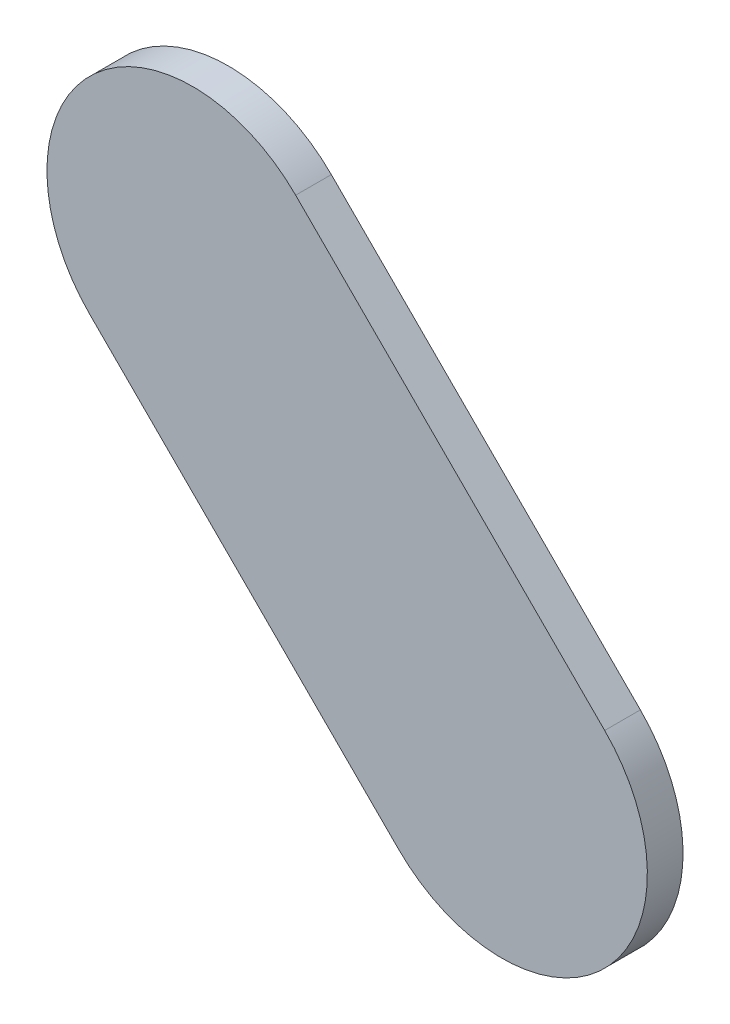
ISO-10303-21;
HEADER;
FILE_DESCRIPTION(('STEP AP214'),'2;1');
FILE_NAME('part.step','',(''),(''),'','','');
FILE_SCHEMA(('AUTOMOTIVE_DESIGN { 1 0 10303 214 1 1 1 1 }'));
ENDSEC;
DATA;
#1=APPLICATION_CONTEXT('core data for automotive mechanical design processes');
#2=APPLICATION_PROTOCOL_DEFINITION('international standard','automotive_design',2000,#1);
#3=PRODUCT_CONTEXT('',#1,'mechanical');
#4=PRODUCT('Part','Part','',(#3));
#5=PRODUCT_RELATED_PRODUCT_CATEGORY('part','',(#4));
#6=PRODUCT_DEFINITION_FORMATION('','',#4);
#7=PRODUCT_DEFINITION_CONTEXT('part definition',#1,'design');
#8=PRODUCT_DEFINITION('design','',#6,#7);
#9=PRODUCT_DEFINITION_SHAPE('','',#8);
#10=(LENGTH_UNIT() NAMED_UNIT(*) SI_UNIT(.MILLI.,.METRE.));
#11=(NAMED_UNIT(*) PLANE_ANGLE_UNIT() SI_UNIT($,.RADIAN.));
#12=(NAMED_UNIT(*) SI_UNIT($,.STERADIAN.) SOLID_ANGLE_UNIT());
#13=UNCERTAINTY_MEASURE_WITH_UNIT(LENGTH_MEASURE(1.E-05),#10,'distance_accuracy_value','');
#14=(GEOMETRIC_REPRESENTATION_CONTEXT(3) GLOBAL_UNCERTAINTY_ASSIGNED_CONTEXT((#13)) GLOBAL_UNIT_ASSIGNED_CONTEXT((#10,
#11,#12)) REPRESENTATION_CONTEXT('',''));
#15=CARTESIAN_POINT('',(0.,0.,0.));
#16=DIRECTION('',(0.,0.,1.));
#17=DIRECTION('',(1.,0.,0.));
#18=AXIS2_PLACEMENT_3D('',#15,#16,#17);
#19=CARTESIAN_POINT('',(4.433035666303,7.678591372288,0.76487));
#20=DIRECTION('',(0.,0.,-1.));
#21=DIRECTION('',(-1.,0.,0.));
#22=AXIS2_PLACEMENT_3D('',#19,#20,#21);
#23=PLANE('',#22);
#24=DIRECTION('',(0.707105987136602,-0.707107575235602,0.));
#25=VECTOR('',#24,1.);
#26=CARTESIAN_POINT('',(4.383645000001,7.925453,0.76487));
#27=LINE('',#26,#25);
#28=CARTESIAN_POINT('',(4.38364503026748,7.92545296973368,0.76487));
#29=VERTEX_POINT('',#28);
#30=CARTESIAN_POINT('',(4.68062955533316,7.62846777766617,0.76487));
#31=VERTEX_POINT('',#30);
#32=EDGE_CURVE('E54',#29,#31,#27,.T.);
#33=ORIENTED_EDGE('',*,*,#32,.T.);
#34=CARTESIAN_POINT('',(4.581634667,7.529472667,0.76487));
#35=DIRECTION('',(0.,0.,1.));
#36=DIRECTION('',(1.,0.,0.));
#37=AXIS2_PLACEMENT_3D('',#34,#35,#36);
#38=CIRCLE('',#37,0.140000070901);
#39=CARTESIAN_POINT('',(4.48263974790159,7.43047825310059,0.76487));
#40=VERTEX_POINT('',#39);
#41=EDGE_CURVE('E20',#40,#31,#38,.T.);
#42=ORIENTED_EDGE('',*,*,#41,.F.);
#43=DIRECTION('',(-0.707107575236102,0.707105987136102,0.));
#44=VECTOR('',#43,1.);
#45=CARTESIAN_POINT('',(4.482639667001,7.430478334001,0.76487));
#46=LINE('',#45,#44);
#47=CARTESIAN_POINT('',(4.18565455583361,7.72746277816655,0.76487));
#48=VERTEX_POINT('',#47);
#49=EDGE_CURVE('E78',#40,#48,#46,.T.);
#50=ORIENTED_EDGE('',*,*,#49,.T.);
#51=CARTESIAN_POINT('',(4.284649333,7.826458,0.76487));
#52=DIRECTION('',(0.,0.,1.));
#53=DIRECTION('',(1.,0.,0.));
#54=AXIS2_PLACEMENT_3D('',#51,#52,#53);
#55=CIRCLE('',#54,0.140000070901);
#56=EDGE_CURVE('E58',#29,#48,#55,.T.);
#57=ORIENTED_EDGE('',*,*,#56,.F.);
#58=EDGE_LOOP('',(#33,#42,#50,#57));
#59=FACE_BOUND('',#58,.T.);
#60=ADVANCED_FACE('F17',(#59),#23,.T.);
#61=CARTESIAN_POINT('',(4.581634667,7.529472667,0.76487));
#62=DIRECTION('',(0.,0.,1.));
#63=DIRECTION('',(1.,0.,0.));
#64=AXIS2_PLACEMENT_3D('',#61,#62,#63);
#65=CYLINDRICAL_SURFACE('',#64,0.140000070901);
#66=ORIENTED_EDGE('',*,*,#41,.T.);
#67=DIRECTION('',(0.,0.,1.));
#68=VECTOR('',#67,1.);
#69=CARTESIAN_POINT('',(4.68062933299991,7.62846799999991,0.76487));
#70=LINE('',#69,#68);
#71=CARTESIAN_POINT('',(4.68062955533321,7.62846777766625,0.79916));
#72=VERTEX_POINT('',#71);
#73=EDGE_CURVE('E62',#31,#72,#70,.T.);
#74=ORIENTED_EDGE('',*,*,#73,.T.);
#75=CARTESIAN_POINT('',(4.581634667001,7.529473232733,0.79916));
#76=DIRECTION('',(0.,0.,1.));
#77=DIRECTION('',(1.,0.,0.));
#78=AXIS2_PLACEMENT_3D('',#75,#76,#77);
#79=CIRCLE('',#78,0.14);
#80=CARTESIAN_POINT('',(4.48263974790162,7.43047825310056,0.79916));
#81=VERTEX_POINT('',#80);
#82=EDGE_CURVE('E82',#81,#72,#79,.T.);
#83=ORIENTED_EDGE('',*,*,#82,.F.);
#84=DIRECTION('',(0.,0.,1.));
#85=VECTOR('',#84,1.);
#86=CARTESIAN_POINT('',(4.482639667001,7.430478334001,0.76487));
#87=LINE('',#86,#85);
#88=EDGE_CURVE('E69',#81,#40,#87,.F.);
#89=ORIENTED_EDGE('',*,*,#88,.T.);
#90=EDGE_LOOP('',(#66,#74,#83,#89));
#91=FACE_BOUND('',#90,.T.);
#92=ADVANCED_FACE('F66',(#91),#65,.T.);
#93=CARTESIAN_POINT('',(4.383645000001,7.925453,0.76487));
#94=DIRECTION('',(-0.707107575235602,-0.707105987136602,0.));
#95=DIRECTION('',(0.707105987136602,-0.707107575235602,0.));
#96=AXIS2_PLACEMENT_3D('',#93,#94,#95);
#97=PLANE('',#96);
#98=ORIENTED_EDGE('',*,*,#73,.F.);
#99=ORIENTED_EDGE('',*,*,#32,.F.);
#100=DIRECTION('',(0.,0.,1.));
#101=VECTOR('',#100,1.);
#102=CARTESIAN_POINT('',(4.38364500000123,7.92545300000023,0.76487));
#103=LINE('',#102,#101);
#104=CARTESIAN_POINT('',(4.38364503026747,7.92545296973369,0.79916));
#105=VERTEX_POINT('',#104);
#106=EDGE_CURVE('E73',#105,#29,#103,.F.);
#107=ORIENTED_EDGE('',*,*,#106,.F.);
#108=DIRECTION('',(-0.707105987136806,0.707107575235397,0.));
#109=VECTOR('',#108,1.);
#110=CARTESIAN_POINT('',(4.680629333,7.628468,0.79916));
#111=LINE('',#110,#109);
#112=EDGE_CURVE('E72',#72,#105,#111,.T.);
#113=ORIENTED_EDGE('',*,*,#112,.F.);
#114=EDGE_LOOP('',(#98,#99,#107,#113));
#115=FACE_BOUND('',#114,.T.);
#116=ADVANCED_FACE('F71',(#115),#97,.F.);
#117=CARTESIAN_POINT('',(4.284649333,7.826458,0.76487));
#118=DIRECTION('',(0.,0.,1.));
#119=DIRECTION('',(1.,0.,0.));
#120=AXIS2_PLACEMENT_3D('',#117,#118,#119);
#121=CYLINDRICAL_SURFACE('',#120,0.140000070901);
#122=ORIENTED_EDGE('',*,*,#56,.T.);
#123=DIRECTION('',(0.,0.,1.));
#124=VECTOR('',#123,1.);
#125=CARTESIAN_POINT('',(4.1856546670002,7.7274626670002,0.76487));
#126=LINE('',#125,#124);
#127=CARTESIAN_POINT('',(4.18565455583354,7.72746277816641,0.79916));
#128=VERTEX_POINT('',#127);
#129=EDGE_CURVE('E79',#48,#128,#126,.T.);
#130=ORIENTED_EDGE('',*,*,#129,.T.);
#131=CARTESIAN_POINT('',(4.284649667,7.826457768268,0.79916));
#132=DIRECTION('',(0.,0.,1.));
#133=DIRECTION('',(1.,0.,0.));
#134=AXIS2_PLACEMENT_3D('',#131,#132,#133);
#135=CIRCLE('',#134,0.140000470934);
#136=EDGE_CURVE('E26',#105,#128,#135,.T.);
#137=ORIENTED_EDGE('',*,*,#136,.F.);
#138=ORIENTED_EDGE('',*,*,#106,.T.);
#139=EDGE_LOOP('',(#122,#130,#137,#138));
#140=FACE_BOUND('',#139,.T.);
#141=ADVANCED_FACE('F91',(#140),#121,.T.);
#142=CARTESIAN_POINT('',(4.482639667001,7.430478334001,0.76487));
#143=DIRECTION('',(0.707105987136102,0.707107575236102,0.));
#144=DIRECTION('',(-0.707107575236102,0.707105987136102,0.));
#145=AXIS2_PLACEMENT_3D('',#142,#143,#144);
#146=PLANE('',#145);
#147=ORIENTED_EDGE('',*,*,#129,.F.);
#148=ORIENTED_EDGE('',*,*,#49,.F.);
#149=ORIENTED_EDGE('',*,*,#88,.F.);
#150=DIRECTION('',(0.707107575236588,-0.707105987135616,0.));
#151=VECTOR('',#150,1.);
#152=CARTESIAN_POINT('',(4.185654667,7.727462667,0.79916));
#153=LINE('',#152,#151);
#154=EDGE_CURVE('E11',#128,#81,#153,.T.);
#155=ORIENTED_EDGE('',*,*,#154,.F.);
#156=EDGE_LOOP('',(#147,#148,#149,#155));
#157=FACE_BOUND('',#156,.T.);
#158=ADVANCED_FACE('F90',(#157),#146,.F.);
#159=CARTESIAN_POINT('',(4.433035666303,7.678591372288,0.79916));
#160=DIRECTION('',(0.,0.,1.));
#161=DIRECTION('',(1.,0.,0.));
#162=AXIS2_PLACEMENT_3D('',#159,#160,#161);
#163=PLANE('',#162);
#164=ORIENTED_EDGE('',*,*,#136,.T.);
#165=ORIENTED_EDGE('',*,*,#154,.T.);
#166=ORIENTED_EDGE('',*,*,#82,.T.);
#167=ORIENTED_EDGE('',*,*,#112,.T.);
#168=EDGE_LOOP('',(#164,#165,#166,#167));
#169=FACE_BOUND('',#168,.T.);
#170=ADVANCED_FACE('F87',(#169),#163,.T.);
#171=CLOSED_SHELL('',(#60,#92,#116,#141,#158,#170));
#172=MANIFOLD_SOLID_BREP('B1',#171);
#173=ADVANCED_BREP_SHAPE_REPRESENTATION('',(#18,#172),#14);
#174=SHAPE_DEFINITION_REPRESENTATION(#9,#173);
ENDSEC;
END-ISO-10303-21;
